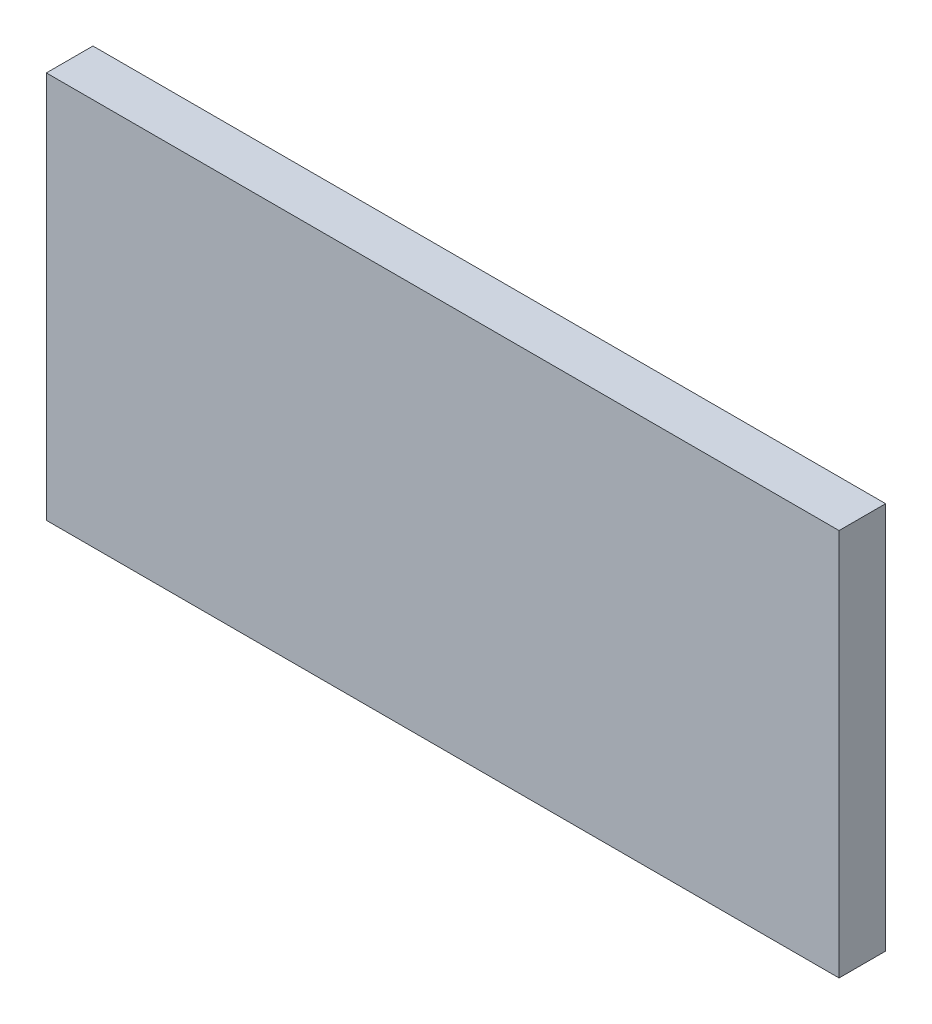
ISO-10303-21;
HEADER;
FILE_DESCRIPTION(('STEP AP214'),'2;1');
FILE_NAME('part.step','',(''),(''),'','','');
FILE_SCHEMA(('AUTOMOTIVE_DESIGN { 1 0 10303 214 1 1 1 1 }'));
ENDSEC;
DATA;
#1=APPLICATION_CONTEXT('core data for automotive mechanical design processes');
#2=APPLICATION_PROTOCOL_DEFINITION('international standard','automotive_design',2000,#1);
#3=PRODUCT_CONTEXT('',#1,'mechanical');
#4=PRODUCT('Part','Part','',(#3));
#5=PRODUCT_RELATED_PRODUCT_CATEGORY('part','',(#4));
#6=PRODUCT_DEFINITION_FORMATION('','',#4);
#7=PRODUCT_DEFINITION_CONTEXT('part definition',#1,'design');
#8=PRODUCT_DEFINITION('design','',#6,#7);
#9=PRODUCT_DEFINITION_SHAPE('','',#8);
#10=(LENGTH_UNIT() NAMED_UNIT(*) SI_UNIT(.MILLI.,.METRE.));
#11=(NAMED_UNIT(*) PLANE_ANGLE_UNIT() SI_UNIT($,.RADIAN.));
#12=(NAMED_UNIT(*) SI_UNIT($,.STERADIAN.) SOLID_ANGLE_UNIT());
#13=UNCERTAINTY_MEASURE_WITH_UNIT(LENGTH_MEASURE(1.E-05),#10,'distance_accuracy_value','');
#14=(GEOMETRIC_REPRESENTATION_CONTEXT(3) GLOBAL_UNCERTAINTY_ASSIGNED_CONTEXT((#13)) GLOBAL_UNIT_ASSIGNED_CONTEXT((#10,
#11,#12)) REPRESENTATION_CONTEXT('',''));
#15=CARTESIAN_POINT('',(0.,0.,0.));
#16=DIRECTION('',(0.,0.,1.));
#17=DIRECTION('',(1.,0.,0.));
#18=AXIS2_PLACEMENT_3D('',#15,#16,#17);
#19=CARTESIAN_POINT('',(-0.851,-0.416,0.));
#20=DIRECTION('',(1.,0.,0.));
#21=DIRECTION('',(0.,0.,1.));
#22=AXIS2_PLACEMENT_3D('',#19,#20,#21);
#23=PLANE('',#22);
#24=DIRECTION('',(0.,1.,0.));
#25=VECTOR('',#24,1.);
#26=CARTESIAN_POINT('',(-0.851,-0.416,0.1));
#27=LINE('',#26,#25);
#28=CARTESIAN_POINT('',(-0.851,-0.416,0.1));
#29=VERTEX_POINT('',#28);
#30=CARTESIAN_POINT('',(-0.851,0.416,0.1));
#31=VERTEX_POINT('',#30);
#32=EDGE_CURVE('E11',#29,#31,#27,.T.);
#33=ORIENTED_EDGE('',*,*,#32,.T.);
#34=DIRECTION('',(0.,0.,1.));
#35=VECTOR('',#34,1.);
#36=CARTESIAN_POINT('',(-0.851,0.416,0.));
#37=LINE('',#36,#35);
#38=CARTESIAN_POINT('',(-0.851,0.416,0.));
#39=VERTEX_POINT('',#38);
#40=EDGE_CURVE('E24',#39,#31,#37,.T.);
#41=ORIENTED_EDGE('',*,*,#40,.F.);
#42=DIRECTION('',(0.,1.,0.));
#43=VECTOR('',#42,1.);
#44=CARTESIAN_POINT('',(-0.851,-0.416,0.));
#45=LINE('',#44,#43);
#46=CARTESIAN_POINT('',(-0.851,-0.416,0.));
#47=VERTEX_POINT('',#46);
#48=EDGE_CURVE('E86',#47,#39,#45,.T.);
#49=ORIENTED_EDGE('',*,*,#48,.F.);
#50=DIRECTION('',(0.,0.,1.));
#51=VECTOR('',#50,1.);
#52=CARTESIAN_POINT('',(-0.851,-0.416,0.));
#53=LINE('',#52,#51);
#54=EDGE_CURVE('E36',#47,#29,#53,.T.);
#55=ORIENTED_EDGE('',*,*,#54,.T.);
#56=EDGE_LOOP('',(#33,#41,#49,#55));
#57=FACE_BOUND('',#56,.T.);
#58=ADVANCED_FACE('F17',(#57),#23,.F.);
#59=CARTESIAN_POINT('',(0.851,-0.416,0.));
#60=DIRECTION('',(1.,0.,0.));
#61=DIRECTION('',(0.,0.,1.));
#62=AXIS2_PLACEMENT_3D('',#59,#60,#61);
#63=PLANE('',#62);
#64=DIRECTION('',(0.,0.,1.));
#65=VECTOR('',#64,1.);
#66=CARTESIAN_POINT('',(0.851,-0.416,0.));
#67=LINE('',#66,#65);
#68=CARTESIAN_POINT('',(0.851,-0.416,0.));
#69=VERTEX_POINT('',#68);
#70=CARTESIAN_POINT('',(0.851,-0.416,0.1));
#71=VERTEX_POINT('',#70);
#72=EDGE_CURVE('E83',#69,#71,#67,.T.);
#73=ORIENTED_EDGE('',*,*,#72,.F.);
#74=DIRECTION('',(0.,1.,0.));
#75=VECTOR('',#74,1.);
#76=CARTESIAN_POINT('',(0.851,-0.416,0.));
#77=LINE('',#76,#75);
#78=CARTESIAN_POINT('',(0.851,0.416,0.));
#79=VERTEX_POINT('',#78);
#80=EDGE_CURVE('E63',#69,#79,#77,.T.);
#81=ORIENTED_EDGE('',*,*,#80,.T.);
#82=DIRECTION('',(0.,0.,1.));
#83=VECTOR('',#82,1.);
#84=CARTESIAN_POINT('',(0.851,0.416,0.));
#85=LINE('',#84,#83);
#86=CARTESIAN_POINT('',(0.851,0.416,0.1));
#87=VERTEX_POINT('',#86);
#88=EDGE_CURVE('E57',#79,#87,#85,.T.);
#89=ORIENTED_EDGE('',*,*,#88,.T.);
#90=DIRECTION('',(0.,1.,0.));
#91=VECTOR('',#90,1.);
#92=CARTESIAN_POINT('',(0.851,-0.416,0.1));
#93=LINE('',#92,#91);
#94=EDGE_CURVE('E60',#71,#87,#93,.T.);
#95=ORIENTED_EDGE('',*,*,#94,.F.);
#96=EDGE_LOOP('',(#73,#81,#89,#95));
#97=FACE_BOUND('',#96,.T.);
#98=ADVANCED_FACE('F59',(#97),#63,.T.);
#99=CARTESIAN_POINT('',(-0.851,-0.416,0.));
#100=DIRECTION('',(0.,1.,0.));
#101=DIRECTION('',(0.,0.,1.));
#102=AXIS2_PLACEMENT_3D('',#99,#100,#101);
#103=PLANE('',#102);
#104=ORIENTED_EDGE('',*,*,#72,.T.);
#105=DIRECTION('',(1.,0.,0.));
#106=VECTOR('',#105,1.);
#107=CARTESIAN_POINT('',(-0.851,-0.416,0.1));
#108=LINE('',#107,#106);
#109=EDGE_CURVE('E71',#29,#71,#108,.T.);
#110=ORIENTED_EDGE('',*,*,#109,.F.);
#111=ORIENTED_EDGE('',*,*,#54,.F.);
#112=DIRECTION('',(1.,0.,0.));
#113=VECTOR('',#112,1.);
#114=CARTESIAN_POINT('',(-0.851,-0.416,0.));
#115=LINE('',#114,#113);
#116=EDGE_CURVE('E76',#47,#69,#115,.T.);
#117=ORIENTED_EDGE('',*,*,#116,.T.);
#118=EDGE_LOOP('',(#104,#110,#111,#117));
#119=FACE_BOUND('',#118,.T.);
#120=ADVANCED_FACE('F91',(#119),#103,.F.);
#121=CARTESIAN_POINT('',(-0.851,0.416,0.));
#122=DIRECTION('',(0.,1.,0.));
#123=DIRECTION('',(0.,0.,1.));
#124=AXIS2_PLACEMENT_3D('',#121,#122,#123);
#125=PLANE('',#124);
#126=DIRECTION('',(1.,0.,0.));
#127=VECTOR('',#126,1.);
#128=CARTESIAN_POINT('',(-0.851,0.416,0.));
#129=LINE('',#128,#127);
#130=EDGE_CURVE('E74',#39,#79,#129,.T.);
#131=ORIENTED_EDGE('',*,*,#130,.F.);
#132=ORIENTED_EDGE('',*,*,#40,.T.);
#133=DIRECTION('',(1.,0.,0.));
#134=VECTOR('',#133,1.);
#135=CARTESIAN_POINT('',(-0.851,0.416,0.1));
#136=LINE('',#135,#134);
#137=EDGE_CURVE('E69',#31,#87,#136,.T.);
#138=ORIENTED_EDGE('',*,*,#137,.T.);
#139=ORIENTED_EDGE('',*,*,#88,.F.);
#140=EDGE_LOOP('',(#131,#132,#138,#139));
#141=FACE_BOUND('',#140,.T.);
#142=ADVANCED_FACE('F73',(#141),#125,.T.);
#143=CARTESIAN_POINT('',(-0.851,-0.416,0.));
#144=DIRECTION('',(0.,0.,1.));
#145=DIRECTION('',(1.,0.,0.));
#146=AXIS2_PLACEMENT_3D('',#143,#144,#145);
#147=PLANE('',#146);
#148=ORIENTED_EDGE('',*,*,#130,.T.);
#149=ORIENTED_EDGE('',*,*,#80,.F.);
#150=ORIENTED_EDGE('',*,*,#116,.F.);
#151=ORIENTED_EDGE('',*,*,#48,.T.);
#152=EDGE_LOOP('',(#148,#149,#150,#151));
#153=FACE_BOUND('',#152,.T.);
#154=ADVANCED_FACE('F89',(#153),#147,.F.);
#155=CARTESIAN_POINT('',(-0.851,-0.416,0.1));
#156=DIRECTION('',(0.,0.,1.));
#157=DIRECTION('',(1.,0.,0.));
#158=AXIS2_PLACEMENT_3D('',#155,#156,#157);
#159=PLANE('',#158);
#160=ORIENTED_EDGE('',*,*,#32,.F.);
#161=ORIENTED_EDGE('',*,*,#109,.T.);
#162=ORIENTED_EDGE('',*,*,#94,.T.);
#163=ORIENTED_EDGE('',*,*,#137,.F.);
#164=EDGE_LOOP('',(#160,#161,#162,#163));
#165=FACE_BOUND('',#164,.T.);
#166=ADVANCED_FACE('F68',(#165),#159,.T.);
#167=CLOSED_SHELL('',(#58,#98,#120,#142,#154,#166));
#168=MANIFOLD_SOLID_BREP('B1',#167);
#169=ADVANCED_BREP_SHAPE_REPRESENTATION('',(#18,#168),#14);
#170=SHAPE_DEFINITION_REPRESENTATION(#9,#169);
ENDSEC;
END-ISO-10303-21;
